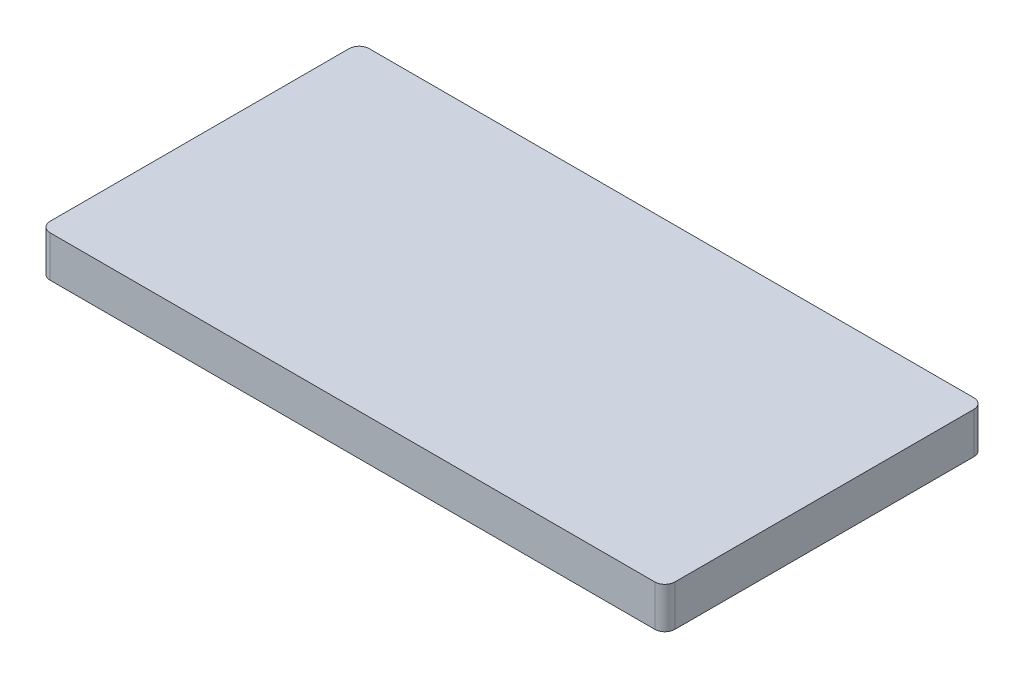
ISO-10303-21;
HEADER;
FILE_DESCRIPTION(('STEP AP214'),'2;1');
FILE_NAME('part.step','',(''),(''),'','','');
FILE_SCHEMA(('AUTOMOTIVE_DESIGN { 1 0 10303 214 1 1 1 1 }'));
ENDSEC;
DATA;
#1=APPLICATION_CONTEXT('core data for automotive mechanical design processes');
#2=APPLICATION_PROTOCOL_DEFINITION('international standard','automotive_design',2000,#1);
#3=PRODUCT_CONTEXT('',#1,'mechanical');
#4=PRODUCT('Part','Part','',(#3));
#5=PRODUCT_RELATED_PRODUCT_CATEGORY('part','',(#4));
#6=PRODUCT_DEFINITION_FORMATION('','',#4);
#7=PRODUCT_DEFINITION_CONTEXT('part definition',#1,'design');
#8=PRODUCT_DEFINITION('design','',#6,#7);
#9=PRODUCT_DEFINITION_SHAPE('','',#8);
#10=(LENGTH_UNIT() NAMED_UNIT(*) SI_UNIT(.MILLI.,.METRE.));
#11=(NAMED_UNIT(*) PLANE_ANGLE_UNIT() SI_UNIT($,.RADIAN.));
#12=(NAMED_UNIT(*) SI_UNIT($,.STERADIAN.) SOLID_ANGLE_UNIT());
#13=UNCERTAINTY_MEASURE_WITH_UNIT(LENGTH_MEASURE(1.E-05),#10,'distance_accuracy_value','');
#14=(GEOMETRIC_REPRESENTATION_CONTEXT(3) GLOBAL_UNCERTAINTY_ASSIGNED_CONTEXT((#13)) GLOBAL_UNIT_ASSIGNED_CONTEXT((#10,
#11,#12)) REPRESENTATION_CONTEXT('',''));
#15=CARTESIAN_POINT('',(0.,0.,0.));
#16=DIRECTION('',(0.,0.,1.));
#17=DIRECTION('',(1.,0.,0.));
#18=AXIS2_PLACEMENT_3D('',#15,#16,#17);
#19=CARTESIAN_POINT('',(-57.8943127962085,8.2,-32.9347748815166));
#20=DIRECTION('',(1.,0.,0.));
#21=DIRECTION('',(0.,0.,-1.));
#22=AXIS2_PLACEMENT_3D('',#19,#20,#21);
#23=PLANE('',#22);
#24=DIRECTION('',(0.,0.,1.));
#25=VECTOR('',#24,1.);
#26=CARTESIAN_POINT('',(-57.8943127962085,2.75,-4.96977488151659));
#27=LINE('',#26,#25);
#28=CARTESIAN_POINT('',(-57.8943127962085,2.75,-4.96977488151659));
#29=VERTEX_POINT('',#28);
#30=CARTESIAN_POINT('',(-57.8943127962085,2.75,2.75022511848341));
#31=VERTEX_POINT('',#30);
#32=EDGE_CURVE('E231',#29,#31,#27,.T.);
#33=ORIENTED_EDGE('',*,*,#32,.F.);
#34=DIRECTION('',(0.,-1.,0.));
#35=VECTOR('',#34,1.);
#36=CARTESIAN_POINT('',(-57.8943127962085,5.45,-4.96977488151659));
#37=LINE('',#36,#35);
#38=CARTESIAN_POINT('',(-57.8943127962085,5.45,-4.96977488151659));
#39=VERTEX_POINT('',#38);
#40=EDGE_CURVE('E229',#39,#29,#37,.T.);
#41=ORIENTED_EDGE('',*,*,#40,.F.);
#42=DIRECTION('',(0.,0.,-1.));
#43=VECTOR('',#42,1.);
#44=CARTESIAN_POINT('',(-57.8943127962085,5.45,-4.96977488151659));
#45=LINE('',#44,#43);
#46=CARTESIAN_POINT('',(-57.8943127962085,5.45,2.75022511848341));
#47=VERTEX_POINT('',#46);
#48=EDGE_CURVE('E219',#47,#39,#45,.T.);
#49=ORIENTED_EDGE('',*,*,#48,.F.);
#50=DIRECTION('',(0.,1.,0.));
#51=VECTOR('',#50,1.);
#52=CARTESIAN_POINT('',(-57.8943127962085,5.45,2.75022511848341));
#53=LINE('',#52,#51);
#54=EDGE_CURVE('E235',#31,#47,#53,.T.);
#55=ORIENTED_EDGE('',*,*,#54,.F.);
#56=EDGE_LOOP('',(#33,#41,#49,#55));
#57=FACE_BOUND('',#56,.T.);
#58=DIRECTION('',(0.,0.,1.));
#59=VECTOR('',#58,1.);
#60=CARTESIAN_POINT('',(-57.8943127962085,1.45,12.0700363323834));
#61=LINE('',#60,#59);
#62=CARTESIAN_POINT('',(-57.8943127962085,1.45,12.0700363323834));
#63=VERTEX_POINT('',#62);
#64=CARTESIAN_POINT('',(-57.8943127962085,1.45,24.3700363323834));
#65=VERTEX_POINT('',#64);
#66=EDGE_CURVE('E264',#63,#65,#61,.T.);
#67=ORIENTED_EDGE('',*,*,#66,.F.);
#68=DIRECTION('',(0.,-1.,0.));
#69=VECTOR('',#68,1.);
#70=CARTESIAN_POINT('',(-57.8943127962085,6.75,12.0700363323834));
#71=LINE('',#70,#69);
#72=CARTESIAN_POINT('',(-57.8943127962085,6.75,12.0700363323834));
#73=VERTEX_POINT('',#72);
#74=EDGE_CURVE('E211',#73,#63,#71,.T.);
#75=ORIENTED_EDGE('',*,*,#74,.F.);
#76=DIRECTION('',(0.,0.,-1.));
#77=VECTOR('',#76,1.);
#78=CARTESIAN_POINT('',(-57.8943127962085,6.75,12.0700363323834));
#79=LINE('',#78,#77);
#80=CARTESIAN_POINT('',(-57.8943127962085,6.75,24.3700363323834));
#81=VERTEX_POINT('',#80);
#82=EDGE_CURVE('E253',#81,#73,#79,.T.);
#83=ORIENTED_EDGE('',*,*,#82,.F.);
#84=DIRECTION('',(0.,1.,0.));
#85=VECTOR('',#84,1.);
#86=CARTESIAN_POINT('',(-57.8943127962085,6.75,24.3700363323834));
#87=LINE('',#86,#85);
#88=EDGE_CURVE('E267',#65,#81,#87,.T.);
#89=ORIENTED_EDGE('',*,*,#88,.F.);
#90=EDGE_LOOP('',(#67,#75,#83,#89));
#91=FACE_BOUND('',#90,.T.);
#92=DIRECTION('',(0.,0.,1.));
#93=VECTOR('',#92,1.);
#94=CARTESIAN_POINT('',(-57.8943127962085,8.2,-32.9347748815166));
#95=LINE('',#94,#93);
#96=CARTESIAN_POINT('',(-57.8943127962085,8.2,-30.9347748815166));
#97=VERTEX_POINT('',#96);
#98=CARTESIAN_POINT('',(-57.8943127962085,8.2,28.7152251184834));
#99=VERTEX_POINT('',#98);
#100=EDGE_CURVE('E279',#97,#99,#95,.T.);
#101=ORIENTED_EDGE('',*,*,#100,.F.);
#102=DIRECTION('',(0.,-1.,0.));
#103=VECTOR('',#102,1.);
#104=CARTESIAN_POINT('',(-57.8943127962085,8.2,-30.9347748815166));
#105=LINE('',#104,#103);
#106=CARTESIAN_POINT('',(-57.8943127962085,0.,-30.9347748815166));
#107=VERTEX_POINT('',#106);
#108=EDGE_CURVE('E11',#97,#107,#105,.T.);
#109=ORIENTED_EDGE('',*,*,#108,.T.);
#110=DIRECTION('',(0.,0.,1.));
#111=VECTOR('',#110,1.);
#112=CARTESIAN_POINT('',(-57.8943127962085,0.,-32.9347748815166));
#113=LINE('',#112,#111);
#114=CARTESIAN_POINT('',(-57.8943127962085,0.,28.7152251184834));
#115=VERTEX_POINT('',#114);
#116=EDGE_CURVE('E242',#107,#115,#113,.T.);
#117=ORIENTED_EDGE('',*,*,#116,.T.);
#118=DIRECTION('',(0.,-1.,0.));
#119=VECTOR('',#118,1.);
#120=CARTESIAN_POINT('',(-57.8943127962085,8.2,28.7152251184834));
#121=LINE('',#120,#119);
#122=EDGE_CURVE('E41',#115,#99,#121,.F.);
#123=ORIENTED_EDGE('',*,*,#122,.T.);
#124=EDGE_LOOP('',(#101,#109,#117,#123));
#125=FACE_BOUND('',#124,.T.);
#126=ADVANCED_FACE('F33',(#57,#91,#125),#23,.F.);
#127=CARTESIAN_POINT('',(-57.8943127962085,8.2,30.7152251184834));
#128=DIRECTION('',(0.,0.,-1.));
#129=DIRECTION('',(-1.,0.,0.));
#130=AXIS2_PLACEMENT_3D('',#127,#128,#129);
#131=PLANE('',#130);
#132=DIRECTION('',(1.,0.,0.));
#133=VECTOR('',#132,1.);
#134=CARTESIAN_POINT('',(-57.8943127962085,0.,30.7152251184834));
#135=LINE('',#134,#133);
#136=CARTESIAN_POINT('',(-55.8943127962085,0.,30.7152251184834));
#137=VERTEX_POINT('',#136);
#138=CARTESIAN_POINT('',(64.7556872037915,0.,30.7152251184834));
#139=VERTEX_POINT('',#138);
#140=EDGE_CURVE('E293',#137,#139,#135,.T.);
#141=ORIENTED_EDGE('',*,*,#140,.T.);
#142=DIRECTION('',(0.,-1.,0.));
#143=VECTOR('',#142,1.);
#144=CARTESIAN_POINT('',(64.7556872037915,8.2,30.7152251184834));
#145=LINE('',#144,#143);
#146=CARTESIAN_POINT('',(64.7556872037915,8.2,30.7152251184834));
#147=VERTEX_POINT('',#146);
#148=EDGE_CURVE('E315',#139,#147,#145,.F.);
#149=ORIENTED_EDGE('',*,*,#148,.T.);
#150=DIRECTION('',(1.,0.,0.));
#151=VECTOR('',#150,1.);
#152=CARTESIAN_POINT('',(-57.8943127962085,8.2,30.7152251184834));
#153=LINE('',#152,#151);
#154=CARTESIAN_POINT('',(-55.8943127962085,8.2,30.7152251184834));
#155=VERTEX_POINT('',#154);
#156=EDGE_CURVE('E282',#155,#147,#153,.T.);
#157=ORIENTED_EDGE('',*,*,#156,.F.);
#158=DIRECTION('',(0.,-1.,0.));
#159=VECTOR('',#158,1.);
#160=CARTESIAN_POINT('',(-55.8943127962085,8.2,30.7152251184834));
#161=LINE('',#160,#159);
#162=EDGE_CURVE('E312',#155,#137,#161,.T.);
#163=ORIENTED_EDGE('',*,*,#162,.T.);
#164=EDGE_LOOP('',(#141,#149,#157,#163));
#165=FACE_BOUND('',#164,.T.);
#166=ADVANCED_FACE('F340',(#165),#131,.F.);
#167=CARTESIAN_POINT('',(66.7556872037915,8.2,-32.9347748815166));
#168=DIRECTION('',(-1.,0.,0.));
#169=DIRECTION('',(0.,0.,1.));
#170=AXIS2_PLACEMENT_3D('',#167,#168,#169);
#171=PLANE('',#170);
#172=DIRECTION('',(0.,0.,-1.));
#173=VECTOR('',#172,1.);
#174=CARTESIAN_POINT('',(66.7556872037915,8.2,-32.9347748815166));
#175=LINE('',#174,#173);
#176=CARTESIAN_POINT('',(66.7556872037915,8.2,28.7152251184834));
#177=VERTEX_POINT('',#176);
#178=CARTESIAN_POINT('',(66.7556872037915,8.2,-30.9347748815166));
#179=VERTEX_POINT('',#178);
#180=EDGE_CURVE('E286',#177,#179,#175,.T.);
#181=ORIENTED_EDGE('',*,*,#180,.F.);
#182=DIRECTION('',(0.,-1.,0.));
#183=VECTOR('',#182,1.);
#184=CARTESIAN_POINT('',(66.7556872037915,8.2,28.7152251184834));
#185=LINE('',#184,#183);
#186=CARTESIAN_POINT('',(66.7556872037915,0.,28.7152251184834));
#187=VERTEX_POINT('',#186);
#188=EDGE_CURVE('E301',#177,#187,#185,.T.);
#189=ORIENTED_EDGE('',*,*,#188,.T.);
#190=DIRECTION('',(0.,0.,-1.));
#191=VECTOR('',#190,1.);
#192=CARTESIAN_POINT('',(66.7556872037915,0.,-32.9347748815166));
#193=LINE('',#192,#191);
#194=CARTESIAN_POINT('',(66.7556872037915,0.,-30.9347748815166));
#195=VERTEX_POINT('',#194);
#196=EDGE_CURVE('E296',#187,#195,#193,.T.);
#197=ORIENTED_EDGE('',*,*,#196,.T.);
#198=DIRECTION('',(0.,-1.,0.));
#199=VECTOR('',#198,1.);
#200=CARTESIAN_POINT('',(66.7556872037915,8.2,-30.9347748815166));
#201=LINE('',#200,#199);
#202=EDGE_CURVE('E290',#195,#179,#201,.F.);
#203=ORIENTED_EDGE('',*,*,#202,.T.);
#204=EDGE_LOOP('',(#181,#189,#197,#203));
#205=FACE_BOUND('',#204,.T.);
#206=ADVANCED_FACE('F351',(#205),#171,.F.);
#207=CARTESIAN_POINT('',(-57.8943127962085,8.2,-32.9347748815166));
#208=DIRECTION('',(0.,0.,1.));
#209=DIRECTION('',(1.,0.,0.));
#210=AXIS2_PLACEMENT_3D('',#207,#208,#209);
#211=PLANE('',#210);
#212=DIRECTION('',(-1.,0.,0.));
#213=VECTOR('',#212,1.);
#214=CARTESIAN_POINT('',(-57.8943127962085,8.2,-32.9347748815166));
#215=LINE('',#214,#213);
#216=CARTESIAN_POINT('',(64.7556872037915,8.2,-32.9347748815166));
#217=VERTEX_POINT('',#216);
#218=CARTESIAN_POINT('',(-55.8943127962085,8.2,-32.9347748815166));
#219=VERTEX_POINT('',#218);
#220=EDGE_CURVE('E288',#217,#219,#215,.T.);
#221=ORIENTED_EDGE('',*,*,#220,.F.);
#222=DIRECTION('',(0.,-1.,0.));
#223=VECTOR('',#222,1.);
#224=CARTESIAN_POINT('',(64.7556872037915,8.2,-32.9347748815166));
#225=LINE('',#224,#223);
#226=CARTESIAN_POINT('',(64.7556872037915,0.,-32.9347748815166));
#227=VERTEX_POINT('',#226);
#228=EDGE_CURVE('E325',#217,#227,#225,.T.);
#229=ORIENTED_EDGE('',*,*,#228,.T.);
#230=DIRECTION('',(-1.,0.,0.));
#231=VECTOR('',#230,1.);
#232=CARTESIAN_POINT('',(-57.8943127962085,0.,-32.9347748815166));
#233=LINE('',#232,#231);
#234=CARTESIAN_POINT('',(-55.8943127962085,0.,-32.9347748815166));
#235=VERTEX_POINT('',#234);
#236=EDGE_CURVE('E283',#227,#235,#233,.T.);
#237=ORIENTED_EDGE('',*,*,#236,.T.);
#238=DIRECTION('',(0.,-1.,0.));
#239=VECTOR('',#238,1.);
#240=CARTESIAN_POINT('',(-55.8943127962085,8.2,-32.9347748815166));
#241=LINE('',#240,#239);
#242=EDGE_CURVE('E48',#235,#219,#241,.F.);
#243=ORIENTED_EDGE('',*,*,#242,.T.);
#244=EDGE_LOOP('',(#221,#229,#237,#243));
#245=FACE_BOUND('',#244,.T.);
#246=ADVANCED_FACE('F357',(#245),#211,.F.);
#247=CARTESIAN_POINT('',(0.,8.2,0.));
#248=DIRECTION('',(0.,1.,0.));
#249=DIRECTION('',(0.,0.,1.));
#250=AXIS2_PLACEMENT_3D('',#247,#248,#249);
#251=PLANE('',#250);
#252=ORIENTED_EDGE('',*,*,#156,.T.);
#253=CARTESIAN_POINT('',(64.7556872037915,8.2,28.7152251184834));
#254=DIRECTION('',(0.,1.,0.));
#255=DIRECTION('',(0.,0.,1.));
#256=AXIS2_PLACEMENT_3D('',#253,#254,#255);
#257=CIRCLE('',#256,2.);
#258=EDGE_CURVE('E322',#147,#177,#257,.T.);
#259=ORIENTED_EDGE('',*,*,#258,.T.);
#260=ORIENTED_EDGE('',*,*,#180,.T.);
#261=CARTESIAN_POINT('',(64.7556872037915,8.2,-30.9347748815166));
#262=DIRECTION('',(0.,1.,0.));
#263=DIRECTION('',(0.,0.,1.));
#264=AXIS2_PLACEMENT_3D('',#261,#262,#263);
#265=CIRCLE('',#264,2.);
#266=EDGE_CURVE('E55',#179,#217,#265,.T.);
#267=ORIENTED_EDGE('',*,*,#266,.T.);
#268=ORIENTED_EDGE('',*,*,#220,.T.);
#269=CARTESIAN_POINT('',(-55.8943127962085,8.2,-30.9347748815166));
#270=DIRECTION('',(0.,1.,0.));
#271=DIRECTION('',(0.,0.,1.));
#272=AXIS2_PLACEMENT_3D('',#269,#270,#271);
#273=CIRCLE('',#272,2.);
#274=EDGE_CURVE('E319',#219,#97,#273,.T.);
#275=ORIENTED_EDGE('',*,*,#274,.T.);
#276=ORIENTED_EDGE('',*,*,#100,.T.);
#277=CARTESIAN_POINT('',(-55.8943127962085,8.2,28.7152251184834));
#278=DIRECTION('',(0.,1.,0.));
#279=DIRECTION('',(0.,0.,1.));
#280=AXIS2_PLACEMENT_3D('',#277,#278,#279);
#281=CIRCLE('',#280,2.);
#282=EDGE_CURVE('E317',#99,#155,#281,.T.);
#283=ORIENTED_EDGE('',*,*,#282,.T.);
#284=EDGE_LOOP('',(#252,#259,#260,#267,#268,#275,#276,#283));
#285=FACE_BOUND('',#284,.T.);
#286=ADVANCED_FACE('F334',(#285),#251,.T.);
#287=CARTESIAN_POINT('',(0.,0.,0.));
#288=DIRECTION('',(0.,1.,0.));
#289=DIRECTION('',(0.,0.,1.));
#290=AXIS2_PLACEMENT_3D('',#287,#288,#289);
#291=PLANE('',#290);
#292=DIRECTION('',(1.,0.,0.));
#293=VECTOR('',#292,1.);
#294=CARTESIAN_POINT('',(-46.6943127962085,0.,-23.9347748815166));
#295=LINE('',#294,#293);
#296=CARTESIAN_POINT('',(-46.6943127962085,0.,-23.9347748815166));
#297=VERTEX_POINT('',#296);
#298=CARTESIAN_POINT('',(-45.6943127962085,0.,-23.9347748815166));
#299=VERTEX_POINT('',#298);
#300=EDGE_CURVE('E205',#297,#299,#295,.T.);
#301=ORIENTED_EDGE('',*,*,#300,.F.);
#302=DIRECTION('',(0.,0.,-1.));
#303=VECTOR('',#302,1.);
#304=CARTESIAN_POINT('',(-46.6943127962085,0.,-14.9347748815166));
#305=LINE('',#304,#303);
#306=CARTESIAN_POINT('',(-46.6943127962085,0.,-14.9347748815166));
#307=VERTEX_POINT('',#306);
#308=EDGE_CURVE('E179',#307,#297,#305,.T.);
#309=ORIENTED_EDGE('',*,*,#308,.F.);
#310=DIRECTION('',(-1.,0.,0.));
#311=VECTOR('',#310,1.);
#312=CARTESIAN_POINT('',(-46.6943127962085,0.,-14.9347748815166));
#313=LINE('',#312,#311);
#314=CARTESIAN_POINT('',(-45.6943127962085,0.,-14.9347748815166));
#315=VERTEX_POINT('',#314);
#316=EDGE_CURVE('E196',#315,#307,#313,.T.);
#317=ORIENTED_EDGE('',*,*,#316,.F.);
#318=DIRECTION('',(0.,0.,1.));
#319=VECTOR('',#318,1.);
#320=CARTESIAN_POINT('',(-45.6943127962085,0.,-14.9347748815166));
#321=LINE('',#320,#319);
#322=EDGE_CURVE('E199',#299,#315,#321,.T.);
#323=ORIENTED_EDGE('',*,*,#322,.F.);
#324=EDGE_LOOP('',(#301,#309,#317,#323));
#325=FACE_BOUND('',#324,.T.);
#326=ORIENTED_EDGE('',*,*,#196,.F.);
#327=CARTESIAN_POINT('',(64.7556872037915,0.,28.7152251184834));
#328=DIRECTION('',(0.,1.,0.));
#329=DIRECTION('',(0.,0.,1.));
#330=AXIS2_PLACEMENT_3D('',#327,#328,#329);
#331=CIRCLE('',#330,2.);
#332=EDGE_CURVE('E310',#187,#139,#331,.F.);
#333=ORIENTED_EDGE('',*,*,#332,.T.);
#334=ORIENTED_EDGE('',*,*,#140,.F.);
#335=CARTESIAN_POINT('',(-55.8943127962085,0.,28.7152251184834));
#336=DIRECTION('',(0.,1.,0.));
#337=DIRECTION('',(0.,0.,1.));
#338=AXIS2_PLACEMENT_3D('',#335,#336,#337);
#339=CIRCLE('',#338,2.);
#340=EDGE_CURVE('E304',#137,#115,#339,.F.);
#341=ORIENTED_EDGE('',*,*,#340,.T.);
#342=ORIENTED_EDGE('',*,*,#116,.F.);
#343=CARTESIAN_POINT('',(-55.8943127962085,0.,-30.9347748815166));
#344=DIRECTION('',(0.,1.,0.));
#345=DIRECTION('',(0.,0.,1.));
#346=AXIS2_PLACEMENT_3D('',#343,#344,#345);
#347=CIRCLE('',#346,2.);
#348=EDGE_CURVE('E306',#107,#235,#347,.F.);
#349=ORIENTED_EDGE('',*,*,#348,.T.);
#350=ORIENTED_EDGE('',*,*,#236,.F.);
#351=CARTESIAN_POINT('',(64.7556872037915,0.,-30.9347748815166));
#352=DIRECTION('',(0.,1.,0.));
#353=DIRECTION('',(0.,0.,1.));
#354=AXIS2_PLACEMENT_3D('',#351,#352,#353);
#355=CIRCLE('',#354,2.);
#356=EDGE_CURVE('E308',#227,#195,#355,.F.);
#357=ORIENTED_EDGE('',*,*,#356,.T.);
#358=EDGE_LOOP('',(#326,#333,#334,#341,#342,#349,#350,#357));
#359=FACE_BOUND('',#358,.T.);
#360=ADVANCED_FACE('F344',(#325,#359),#291,.F.);
#361=CARTESIAN_POINT('',(-45.8943127962085,6.75,12.0700363323834));
#362=DIRECTION('',(0.,0.,-1.));
#363=DIRECTION('',(-1.,0.,0.));
#364=AXIS2_PLACEMENT_3D('',#361,#362,#363);
#365=PLANE('',#364);
#366=ORIENTED_EDGE('',*,*,#74,.T.);
#367=DIRECTION('',(-1.,0.,0.));
#368=VECTOR('',#367,1.);
#369=CARTESIAN_POINT('',(-45.8943127962085,1.45,12.0700363323834));
#370=LINE('',#369,#368);
#371=CARTESIAN_POINT('',(-45.8943127962085,1.45,12.0700363323834));
#372=VERTEX_POINT('',#371);
#373=EDGE_CURVE('E262',#372,#63,#370,.T.);
#374=ORIENTED_EDGE('',*,*,#373,.F.);
#375=DIRECTION('',(0.,-1.,0.));
#376=VECTOR('',#375,1.);
#377=CARTESIAN_POINT('',(-45.8943127962085,6.75,12.0700363323834));
#378=LINE('',#377,#376);
#379=CARTESIAN_POINT('',(-45.8943127962085,6.75,12.0700363323834));
#380=VERTEX_POINT('',#379);
#381=EDGE_CURVE('E249',#380,#372,#378,.T.);
#382=ORIENTED_EDGE('',*,*,#381,.F.);
#383=DIRECTION('',(-1.,0.,0.));
#384=VECTOR('',#383,1.);
#385=CARTESIAN_POINT('',(-45.8943127962085,6.75,12.0700363323834));
#386=LINE('',#385,#384);
#387=EDGE_CURVE('E232',#380,#73,#386,.T.);
#388=ORIENTED_EDGE('',*,*,#387,.T.);
#389=EDGE_LOOP('',(#366,#374,#382,#388));
#390=FACE_BOUND('',#389,.T.);
#391=ADVANCED_FACE('F426',(#390),#365,.F.);
#392=CARTESIAN_POINT('',(-45.8943127962085,6.75,12.0700363323834));
#393=DIRECTION('',(0.,1.,0.));
#394=DIRECTION('',(0.,0.,1.));
#395=AXIS2_PLACEMENT_3D('',#392,#393,#394);
#396=PLANE('',#395);
#397=ORIENTED_EDGE('',*,*,#82,.T.);
#398=ORIENTED_EDGE('',*,*,#387,.F.);
#399=DIRECTION('',(0.,0.,-1.));
#400=VECTOR('',#399,1.);
#401=CARTESIAN_POINT('',(-45.8943127962085,6.75,12.0700363323834));
#402=LINE('',#401,#400);
#403=CARTESIAN_POINT('',(-45.8943127962085,6.75,24.3700363323834));
#404=VERTEX_POINT('',#403);
#405=EDGE_CURVE('E259',#404,#380,#402,.T.);
#406=ORIENTED_EDGE('',*,*,#405,.F.);
#407=DIRECTION('',(-1.,0.,0.));
#408=VECTOR('',#407,1.);
#409=CARTESIAN_POINT('',(-45.8943127962085,6.75,24.3700363323834));
#410=LINE('',#409,#408);
#411=EDGE_CURVE('E273',#404,#81,#410,.T.);
#412=ORIENTED_EDGE('',*,*,#411,.T.);
#413=EDGE_LOOP('',(#397,#398,#406,#412));
#414=FACE_BOUND('',#413,.T.);
#415=ADVANCED_FACE('F422',(#414),#396,.F.);
#416=CARTESIAN_POINT('',(-45.8943127962085,6.75,24.3700363323834));
#417=DIRECTION('',(0.,0.,1.));
#418=DIRECTION('',(1.,0.,0.));
#419=AXIS2_PLACEMENT_3D('',#416,#417,#418);
#420=PLANE('',#419);
#421=ORIENTED_EDGE('',*,*,#88,.T.);
#422=ORIENTED_EDGE('',*,*,#411,.F.);
#423=DIRECTION('',(0.,1.,0.));
#424=VECTOR('',#423,1.);
#425=CARTESIAN_POINT('',(-45.8943127962085,6.75,24.3700363323834));
#426=LINE('',#425,#424);
#427=CARTESIAN_POINT('',(-45.8943127962085,1.45,24.3700363323834));
#428=VERTEX_POINT('',#427);
#429=EDGE_CURVE('E256',#428,#404,#426,.T.);
#430=ORIENTED_EDGE('',*,*,#429,.F.);
#431=DIRECTION('',(-1.,0.,0.));
#432=VECTOR('',#431,1.);
#433=CARTESIAN_POINT('',(-45.8943127962085,1.45,24.3700363323834));
#434=LINE('',#433,#432);
#435=EDGE_CURVE('E275',#428,#65,#434,.T.);
#436=ORIENTED_EDGE('',*,*,#435,.T.);
#437=EDGE_LOOP('',(#421,#422,#430,#436));
#438=FACE_BOUND('',#437,.T.);
#439=ADVANCED_FACE('F425',(#438),#420,.F.);
#440=CARTESIAN_POINT('',(-45.8943127962085,1.45,12.0700363323834));
#441=DIRECTION('',(0.,-1.,0.));
#442=DIRECTION('',(0.,0.,-1.));
#443=AXIS2_PLACEMENT_3D('',#440,#441,#442);
#444=PLANE('',#443);
#445=ORIENTED_EDGE('',*,*,#66,.T.);
#446=ORIENTED_EDGE('',*,*,#435,.F.);
#447=DIRECTION('',(0.,0.,1.));
#448=VECTOR('',#447,1.);
#449=CARTESIAN_POINT('',(-45.8943127962085,1.45,12.0700363323834));
#450=LINE('',#449,#448);
#451=EDGE_CURVE('E252',#372,#428,#450,.T.);
#452=ORIENTED_EDGE('',*,*,#451,.F.);
#453=ORIENTED_EDGE('',*,*,#373,.T.);
#454=EDGE_LOOP('',(#445,#446,#452,#453));
#455=FACE_BOUND('',#454,.T.);
#456=ADVANCED_FACE('F420',(#455),#444,.F.);
#457=CARTESIAN_POINT('',(-45.8943127962085,0.,0.));
#458=DIRECTION('',(-1.,0.,0.));
#459=DIRECTION('',(0.,0.,1.));
#460=AXIS2_PLACEMENT_3D('',#457,#458,#459);
#461=PLANE('',#460);
#462=ORIENTED_EDGE('',*,*,#381,.T.);
#463=ORIENTED_EDGE('',*,*,#451,.T.);
#464=ORIENTED_EDGE('',*,*,#429,.T.);
#465=ORIENTED_EDGE('',*,*,#405,.T.);
#466=EDGE_LOOP('',(#462,#463,#464,#465));
#467=FACE_BOUND('',#466,.T.);
#468=ADVANCED_FACE('F416',(#467),#461,.T.);
#469=CARTESIAN_POINT('',(-45.8943127962085,5.45,-4.96977488151659));
#470=DIRECTION('',(0.,0.,-1.));
#471=DIRECTION('',(-1.,0.,0.));
#472=AXIS2_PLACEMENT_3D('',#469,#470,#471);
#473=PLANE('',#472);
#474=ORIENTED_EDGE('',*,*,#40,.T.);
#475=DIRECTION('',(-1.,0.,0.));
#476=VECTOR('',#475,1.);
#477=CARTESIAN_POINT('',(-45.8943127962085,2.75,-4.96977488151659));
#478=LINE('',#477,#476);
#479=CARTESIAN_POINT('',(-45.8943127962085,2.75,-4.96977488151659));
#480=VERTEX_POINT('',#479);
#481=EDGE_CURVE('E228',#480,#29,#478,.T.);
#482=ORIENTED_EDGE('',*,*,#481,.F.);
#483=DIRECTION('',(0.,-1.,0.));
#484=VECTOR('',#483,1.);
#485=CARTESIAN_POINT('',(-45.8943127962085,5.45,-4.96977488151659));
#486=LINE('',#485,#484);
#487=CARTESIAN_POINT('',(-45.8943127962085,5.45,-4.96977488151659));
#488=VERTEX_POINT('',#487);
#489=EDGE_CURVE('E215',#488,#480,#486,.T.);
#490=ORIENTED_EDGE('',*,*,#489,.F.);
#491=DIRECTION('',(-1.,0.,0.));
#492=VECTOR('',#491,1.);
#493=CARTESIAN_POINT('',(-45.8943127962085,5.45,-4.96977488151659));
#494=LINE('',#493,#492);
#495=EDGE_CURVE('E240',#488,#39,#494,.T.);
#496=ORIENTED_EDGE('',*,*,#495,.T.);
#497=EDGE_LOOP('',(#474,#482,#490,#496));
#498=FACE_BOUND('',#497,.T.);
#499=ADVANCED_FACE('F406',(#498),#473,.F.);
#500=CARTESIAN_POINT('',(-45.8943127962085,5.45,-4.96977488151659));
#501=DIRECTION('',(0.,1.,0.));
#502=DIRECTION('',(0.,0.,1.));
#503=AXIS2_PLACEMENT_3D('',#500,#501,#502);
#504=PLANE('',#503);
#505=ORIENTED_EDGE('',*,*,#48,.T.);
#506=ORIENTED_EDGE('',*,*,#495,.F.);
#507=DIRECTION('',(0.,0.,-1.));
#508=VECTOR('',#507,1.);
#509=CARTESIAN_POINT('',(-45.8943127962085,5.45,-4.96977488151659));
#510=LINE('',#509,#508);
#511=CARTESIAN_POINT('',(-45.8943127962085,5.45,2.75022511848341));
#512=VERTEX_POINT('',#511);
#513=EDGE_CURVE('E225',#512,#488,#510,.T.);
#514=ORIENTED_EDGE('',*,*,#513,.F.);
#515=DIRECTION('',(-1.,0.,0.));
#516=VECTOR('',#515,1.);
#517=CARTESIAN_POINT('',(-45.8943127962085,5.45,2.75022511848341));
#518=LINE('',#517,#516);
#519=EDGE_CURVE('E243',#512,#47,#518,.T.);
#520=ORIENTED_EDGE('',*,*,#519,.T.);
#521=EDGE_LOOP('',(#505,#506,#514,#520));
#522=FACE_BOUND('',#521,.T.);
#523=ADVANCED_FACE('F402',(#522),#504,.F.);
#524=CARTESIAN_POINT('',(-45.8943127962085,5.45,2.75022511848341));
#525=DIRECTION('',(0.,0.,1.));
#526=DIRECTION('',(1.,0.,0.));
#527=AXIS2_PLACEMENT_3D('',#524,#525,#526);
#528=PLANE('',#527);
#529=ORIENTED_EDGE('',*,*,#54,.T.);
#530=ORIENTED_EDGE('',*,*,#519,.F.);
#531=DIRECTION('',(0.,1.,0.));
#532=VECTOR('',#531,1.);
#533=CARTESIAN_POINT('',(-45.8943127962085,5.45,2.75022511848341));
#534=LINE('',#533,#532);
#535=CARTESIAN_POINT('',(-45.8943127962085,2.75,2.75022511848341));
#536=VERTEX_POINT('',#535);
#537=EDGE_CURVE('E222',#536,#512,#534,.T.);
#538=ORIENTED_EDGE('',*,*,#537,.F.);
#539=DIRECTION('',(-1.,0.,0.));
#540=VECTOR('',#539,1.);
#541=CARTESIAN_POINT('',(-45.8943127962085,2.75,2.75022511848341));
#542=LINE('',#541,#540);
#543=EDGE_CURVE('E245',#536,#31,#542,.T.);
#544=ORIENTED_EDGE('',*,*,#543,.T.);
#545=EDGE_LOOP('',(#529,#530,#538,#544));
#546=FACE_BOUND('',#545,.T.);
#547=ADVANCED_FACE('F405',(#546),#528,.F.);
#548=CARTESIAN_POINT('',(-45.8943127962085,2.75,-4.96977488151659));
#549=DIRECTION('',(0.,-1.,0.));
#550=DIRECTION('',(0.,0.,-1.));
#551=AXIS2_PLACEMENT_3D('',#548,#549,#550);
#552=PLANE('',#551);
#553=ORIENTED_EDGE('',*,*,#32,.T.);
#554=ORIENTED_EDGE('',*,*,#543,.F.);
#555=DIRECTION('',(0.,0.,1.));
#556=VECTOR('',#555,1.);
#557=CARTESIAN_POINT('',(-45.8943127962085,2.75,-4.96977488151659));
#558=LINE('',#557,#556);
#559=EDGE_CURVE('E218',#480,#536,#558,.T.);
#560=ORIENTED_EDGE('',*,*,#559,.F.);
#561=ORIENTED_EDGE('',*,*,#481,.T.);
#562=EDGE_LOOP('',(#553,#554,#560,#561));
#563=FACE_BOUND('',#562,.T.);
#564=ADVANCED_FACE('F400',(#563),#552,.F.);
#565=CARTESIAN_POINT('',(-45.8943127962085,0.,0.));
#566=DIRECTION('',(-1.,0.,0.));
#567=DIRECTION('',(0.,0.,1.));
#568=AXIS2_PLACEMENT_3D('',#565,#566,#567);
#569=PLANE('',#568);
#570=ORIENTED_EDGE('',*,*,#489,.T.);
#571=ORIENTED_EDGE('',*,*,#559,.T.);
#572=ORIENTED_EDGE('',*,*,#537,.T.);
#573=ORIENTED_EDGE('',*,*,#513,.T.);
#574=EDGE_LOOP('',(#570,#571,#572,#573));
#575=FACE_BOUND('',#574,.T.);
#576=ADVANCED_FACE('F397',(#575),#569,.T.);
#577=CARTESIAN_POINT('',(-46.6943127962085,1.,-14.9347748815166));
#578=DIRECTION('',(-1.,0.,0.));
#579=DIRECTION('',(0.,0.,1.));
#580=AXIS2_PLACEMENT_3D('',#577,#578,#579);
#581=PLANE('',#580);
#582=ORIENTED_EDGE('',*,*,#308,.T.);
#583=DIRECTION('',(0.,-1.,0.));
#584=VECTOR('',#583,1.);
#585=CARTESIAN_POINT('',(-46.6943127962085,1.,-23.9347748815166));
#586=LINE('',#585,#584);
#587=CARTESIAN_POINT('',(-46.6943127962085,1.,-23.9347748815166));
#588=VERTEX_POINT('',#587);
#589=EDGE_CURVE('E172',#588,#297,#586,.T.);
#590=ORIENTED_EDGE('',*,*,#589,.F.);
#591=DIRECTION('',(0.,0.,-1.));
#592=VECTOR('',#591,1.);
#593=CARTESIAN_POINT('',(-46.6943127962085,1.,-14.9347748815166));
#594=LINE('',#593,#592);
#595=CARTESIAN_POINT('',(-46.6943127962085,1.,-14.9347748815166));
#596=VERTEX_POINT('',#595);
#597=EDGE_CURVE('E176',#596,#588,#594,.T.);
#598=ORIENTED_EDGE('',*,*,#597,.F.);
#599=DIRECTION('',(0.,-1.,0.));
#600=VECTOR('',#599,1.);
#601=CARTESIAN_POINT('',(-46.6943127962085,1.,-14.9347748815166));
#602=LINE('',#601,#600);
#603=EDGE_CURVE('E209',#596,#307,#602,.T.);
#604=ORIENTED_EDGE('',*,*,#603,.T.);
#605=EDGE_LOOP('',(#582,#590,#598,#604));
#606=FACE_BOUND('',#605,.T.);
#607=ADVANCED_FACE('F174',(#606),#581,.F.);
#608=CARTESIAN_POINT('',(-46.6943127962085,1.,-14.9347748815166));
#609=DIRECTION('',(0.,0.,1.));
#610=DIRECTION('',(1.,0.,0.));
#611=AXIS2_PLACEMENT_3D('',#608,#609,#610);
#612=PLANE('',#611);
#613=ORIENTED_EDGE('',*,*,#316,.T.);
#614=ORIENTED_EDGE('',*,*,#603,.F.);
#615=DIRECTION('',(-1.,0.,0.));
#616=VECTOR('',#615,1.);
#617=CARTESIAN_POINT('',(-46.6943127962085,1.,-14.9347748815166));
#618=LINE('',#617,#616);
#619=CARTESIAN_POINT('',(-45.6943127962085,1.,-14.9347748815166));
#620=VERTEX_POINT('',#619);
#621=EDGE_CURVE('E184',#620,#596,#618,.T.);
#622=ORIENTED_EDGE('',*,*,#621,.F.);
#623=DIRECTION('',(0.,-1.,0.));
#624=VECTOR('',#623,1.);
#625=CARTESIAN_POINT('',(-45.6943127962085,1.,-14.9347748815166));
#626=LINE('',#625,#624);
#627=EDGE_CURVE('E212',#620,#315,#626,.T.);
#628=ORIENTED_EDGE('',*,*,#627,.T.);
#629=EDGE_LOOP('',(#613,#614,#622,#628));
#630=FACE_BOUND('',#629,.T.);
#631=ADVANCED_FACE('F388',(#630),#612,.F.);
#632=CARTESIAN_POINT('',(-45.6943127962085,1.,-14.9347748815166));
#633=DIRECTION('',(1.,0.,0.));
#634=DIRECTION('',(0.,0.,-1.));
#635=AXIS2_PLACEMENT_3D('',#632,#633,#634);
#636=PLANE('',#635);
#637=ORIENTED_EDGE('',*,*,#322,.T.);
#638=ORIENTED_EDGE('',*,*,#627,.F.);
#639=DIRECTION('',(0.,0.,1.));
#640=VECTOR('',#639,1.);
#641=CARTESIAN_POINT('',(-45.6943127962085,1.,-14.9347748815166));
#642=LINE('',#641,#640);
#643=CARTESIAN_POINT('',(-45.6943127962085,1.,-23.9347748815166));
#644=VERTEX_POINT('',#643);
#645=EDGE_CURVE('E192',#644,#620,#642,.T.);
#646=ORIENTED_EDGE('',*,*,#645,.F.);
#647=DIRECTION('',(0.,-1.,0.));
#648=VECTOR('',#647,1.);
#649=CARTESIAN_POINT('',(-45.6943127962085,1.,-23.9347748815166));
#650=LINE('',#649,#648);
#651=EDGE_CURVE('E183',#644,#299,#650,.T.);
#652=ORIENTED_EDGE('',*,*,#651,.T.);
#653=EDGE_LOOP('',(#637,#638,#646,#652));
#654=FACE_BOUND('',#653,.T.);
#655=ADVANCED_FACE('F385',(#654),#636,.F.);
#656=CARTESIAN_POINT('',(-46.6943127962085,1.,-23.9347748815166));
#657=DIRECTION('',(0.,0.,-1.));
#658=DIRECTION('',(-1.,0.,0.));
#659=AXIS2_PLACEMENT_3D('',#656,#657,#658);
#660=PLANE('',#659);
#661=ORIENTED_EDGE('',*,*,#300,.T.);
#662=ORIENTED_EDGE('',*,*,#651,.F.);
#663=DIRECTION('',(1.,0.,0.));
#664=VECTOR('',#663,1.);
#665=CARTESIAN_POINT('',(-46.6943127962085,1.,-23.9347748815166));
#666=LINE('',#665,#664);
#667=EDGE_CURVE('E187',#588,#644,#666,.T.);
#668=ORIENTED_EDGE('',*,*,#667,.F.);
#669=ORIENTED_EDGE('',*,*,#589,.T.);
#670=EDGE_LOOP('',(#661,#662,#668,#669));
#671=FACE_BOUND('',#670,.T.);
#672=ADVANCED_FACE('F188',(#671),#660,.F.);
#673=CARTESIAN_POINT('',(0.,1.,0.));
#674=DIRECTION('',(0.,-1.,0.));
#675=DIRECTION('',(0.,0.,-1.));
#676=AXIS2_PLACEMENT_3D('',#673,#674,#675);
#677=PLANE('',#676);
#678=ORIENTED_EDGE('',*,*,#597,.T.);
#679=ORIENTED_EDGE('',*,*,#667,.T.);
#680=ORIENTED_EDGE('',*,*,#645,.T.);
#681=ORIENTED_EDGE('',*,*,#621,.T.);
#682=EDGE_LOOP('',(#678,#679,#680,#681));
#683=FACE_BOUND('',#682,.T.);
#684=ADVANCED_FACE('F194',(#683),#677,.T.);
#685=CARTESIAN_POINT('',(64.7556872037915,8.2,28.7152251184834));
#686=DIRECTION('',(0.,-1.,0.));
#687=DIRECTION('',(0.,0.,-1.));
#688=AXIS2_PLACEMENT_3D('',#685,#686,#687);
#689=CYLINDRICAL_SURFACE('',#688,2.);
#690=ORIENTED_EDGE('',*,*,#258,.F.);
#691=ORIENTED_EDGE('',*,*,#148,.F.);
#692=ORIENTED_EDGE('',*,*,#332,.F.);
#693=ORIENTED_EDGE('',*,*,#188,.F.);
#694=EDGE_LOOP('',(#690,#691,#692,#693));
#695=FACE_BOUND('',#694,.T.);
#696=ADVANCED_FACE('F348',(#695),#689,.T.);
#697=CARTESIAN_POINT('',(64.7556872037915,8.2,-30.9347748815166));
#698=DIRECTION('',(0.,-1.,0.));
#699=DIRECTION('',(0.,0.,-1.));
#700=AXIS2_PLACEMENT_3D('',#697,#698,#699);
#701=CYLINDRICAL_SURFACE('',#700,2.);
#702=ORIENTED_EDGE('',*,*,#266,.F.);
#703=ORIENTED_EDGE('',*,*,#202,.F.);
#704=ORIENTED_EDGE('',*,*,#356,.F.);
#705=ORIENTED_EDGE('',*,*,#228,.F.);
#706=EDGE_LOOP('',(#702,#703,#704,#705));
#707=FACE_BOUND('',#706,.T.);
#708=ADVANCED_FACE('F355',(#707),#701,.T.);
#709=CARTESIAN_POINT('',(-55.8943127962085,8.2,-30.9347748815166));
#710=DIRECTION('',(0.,-1.,0.));
#711=DIRECTION('',(0.,0.,-1.));
#712=AXIS2_PLACEMENT_3D('',#709,#710,#711);
#713=CYLINDRICAL_SURFACE('',#712,2.);
#714=ORIENTED_EDGE('',*,*,#274,.F.);
#715=ORIENTED_EDGE('',*,*,#242,.F.);
#716=ORIENTED_EDGE('',*,*,#348,.F.);
#717=ORIENTED_EDGE('',*,*,#108,.F.);
#718=EDGE_LOOP('',(#714,#715,#716,#717));
#719=FACE_BOUND('',#718,.T.);
#720=ADVANCED_FACE('F359',(#719),#713,.T.);
#721=CARTESIAN_POINT('',(-55.8943127962085,8.2,28.7152251184834));
#722=DIRECTION('',(0.,-1.,0.));
#723=DIRECTION('',(0.,0.,-1.));
#724=AXIS2_PLACEMENT_3D('',#721,#722,#723);
#725=CYLINDRICAL_SURFACE('',#724,2.);
#726=ORIENTED_EDGE('',*,*,#282,.F.);
#727=ORIENTED_EDGE('',*,*,#122,.F.);
#728=ORIENTED_EDGE('',*,*,#340,.F.);
#729=ORIENTED_EDGE('',*,*,#162,.F.);
#730=EDGE_LOOP('',(#726,#727,#728,#729));
#731=FACE_BOUND('',#730,.T.);
#732=ADVANCED_FACE('F35',(#731),#725,.T.);
#733=CLOSED_SHELL('',(#126,#166,#206,#246,#286,#360,#391,#415,#439,#456,#468,#499,#523,#547,
#564,#576,#607,#631,#655,#672,#684,#696,#708,#720,#732));
#734=MANIFOLD_SOLID_BREP('B2',#733);
#735=ADVANCED_BREP_SHAPE_REPRESENTATION('',(#18,#734),#14);
#736=SHAPE_DEFINITION_REPRESENTATION(#9,#735);
ENDSEC;
END-ISO-10303-21;
